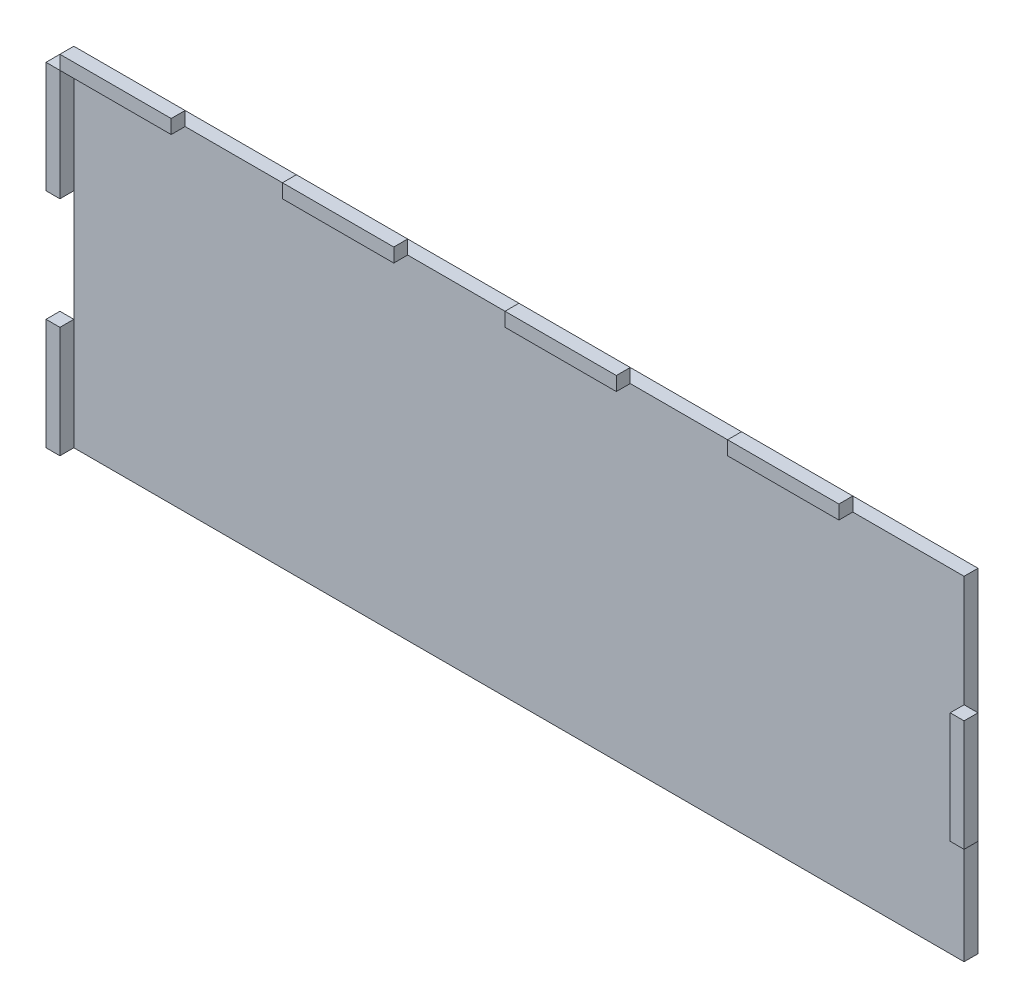
ISO-10303-21;
HEADER;
FILE_DESCRIPTION(('STEP AP214'),'2;1');
FILE_NAME('part.step','',(''),(''),'','','');
FILE_SCHEMA(('AUTOMOTIVE_DESIGN { 1 0 10303 214 1 1 1 1 }'));
ENDSEC;
DATA;
#1=APPLICATION_CONTEXT('core data for automotive mechanical design processes');
#2=APPLICATION_PROTOCOL_DEFINITION('international standard','automotive_design',2000,#1);
#3=PRODUCT_CONTEXT('',#1,'mechanical');
#4=PRODUCT('Part','Part','',(#3));
#5=PRODUCT_RELATED_PRODUCT_CATEGORY('part','',(#4));
#6=PRODUCT_DEFINITION_FORMATION('','',#4);
#7=PRODUCT_DEFINITION_CONTEXT('part definition',#1,'design');
#8=PRODUCT_DEFINITION('design','',#6,#7);
#9=PRODUCT_DEFINITION_SHAPE('','',#8);
#10=(LENGTH_UNIT() NAMED_UNIT(*) SI_UNIT(.MILLI.,.METRE.));
#11=(NAMED_UNIT(*) PLANE_ANGLE_UNIT() SI_UNIT($,.RADIAN.));
#12=(NAMED_UNIT(*) SI_UNIT($,.STERADIAN.) SOLID_ANGLE_UNIT());
#13=UNCERTAINTY_MEASURE_WITH_UNIT(LENGTH_MEASURE(1.E-05),#10,'distance_accuracy_value','');
#14=(GEOMETRIC_REPRESENTATION_CONTEXT(3) GLOBAL_UNCERTAINTY_ASSIGNED_CONTEXT((#13)) GLOBAL_UNIT_ASSIGNED_CONTEXT((#10,
#11,#12)) REPRESENTATION_CONTEXT('',''));
#15=CARTESIAN_POINT('',(0.,0.,0.));
#16=DIRECTION('',(0.,0.,1.));
#17=DIRECTION('',(1.,0.,0.));
#18=AXIS2_PLACEMENT_3D('',#15,#16,#17);
#19=CARTESIAN_POINT('',(101.6,12.7,6.35));
#20=DIRECTION('',(1.,0.,0.));
#21=DIRECTION('',(0.,0.,-1.));
#22=AXIS2_PLACEMENT_3D('',#19,#20,#21);
#23=PLANE('',#22);
#24=DIRECTION('',(0.,-1.,0.));
#25=VECTOR('',#24,1.);
#26=CARTESIAN_POINT('',(101.6,12.7,3.175));
#27=LINE('',#26,#25);
#28=CARTESIAN_POINT('',(101.6,12.7,3.175));
#29=VERTEX_POINT('',#28);
#30=CARTESIAN_POINT('',(101.6,-12.7,3.175));
#31=VERTEX_POINT('',#30);
#32=EDGE_CURVE('E113',#29,#31,#27,.T.);
#33=ORIENTED_EDGE('',*,*,#32,.T.);
#34=DIRECTION('',(0.,0.,-1.));
#35=VECTOR('',#34,1.);
#36=CARTESIAN_POINT('',(101.6,-12.7,6.35));
#37=LINE('',#36,#35);
#38=CARTESIAN_POINT('',(101.6,-12.7,6.35));
#39=VERTEX_POINT('',#38);
#40=EDGE_CURVE('E12',#39,#31,#37,.T.);
#41=ORIENTED_EDGE('',*,*,#40,.F.);
#42=DIRECTION('',(0.,-1.,0.));
#43=VECTOR('',#42,1.);
#44=CARTESIAN_POINT('',(101.6,12.7,6.35));
#45=LINE('',#44,#43);
#46=CARTESIAN_POINT('',(101.6,12.7,6.35));
#47=VERTEX_POINT('',#46);
#48=EDGE_CURVE('E101',#47,#39,#45,.T.);
#49=ORIENTED_EDGE('',*,*,#48,.F.);
#50=DIRECTION('',(0.,0.,-1.));
#51=VECTOR('',#50,1.);
#52=CARTESIAN_POINT('',(101.6,12.7,6.35));
#53=LINE('',#52,#51);
#54=EDGE_CURVE('E109',#47,#29,#53,.T.);
#55=ORIENTED_EDGE('',*,*,#54,.T.);
#56=EDGE_LOOP('',(#33,#41,#49,#55));
#57=FACE_BOUND('',#56,.T.);
#58=ADVANCED_FACE('F50',(#57),#23,.F.);
#59=CARTESIAN_POINT('',(101.6,-12.7,6.35));
#60=DIRECTION('',(0.,1.,0.));
#61=DIRECTION('',(0.,0.,1.));
#62=AXIS2_PLACEMENT_3D('',#59,#60,#61);
#63=PLANE('',#62);
#64=DIRECTION('',(1.,0.,0.));
#65=VECTOR('',#64,1.);
#66=CARTESIAN_POINT('',(101.6,-12.7,3.175));
#67=LINE('',#66,#65);
#68=CARTESIAN_POINT('',(104.775,-12.7,3.175));
#69=VERTEX_POINT('',#68);
#70=EDGE_CURVE('E105',#31,#69,#67,.T.);
#71=ORIENTED_EDGE('',*,*,#70,.T.);
#72=DIRECTION('',(0.,0.,-1.));
#73=VECTOR('',#72,1.);
#74=CARTESIAN_POINT('',(104.775,-12.7,6.35));
#75=LINE('',#74,#73);
#76=CARTESIAN_POINT('',(104.775,-12.7,6.35));
#77=VERTEX_POINT('',#76);
#78=EDGE_CURVE('E58',#77,#69,#75,.T.);
#79=ORIENTED_EDGE('',*,*,#78,.F.);
#80=DIRECTION('',(1.,0.,0.));
#81=VECTOR('',#80,1.);
#82=CARTESIAN_POINT('',(101.6,-12.7,6.35));
#83=LINE('',#82,#81);
#84=EDGE_CURVE('E96',#39,#77,#83,.T.);
#85=ORIENTED_EDGE('',*,*,#84,.F.);
#86=ORIENTED_EDGE('',*,*,#40,.T.);
#87=EDGE_LOOP('',(#71,#79,#85,#86));
#88=FACE_BOUND('',#87,.T.);
#89=ADVANCED_FACE('F104',(#88),#63,.F.);
#90=CARTESIAN_POINT('',(104.775,12.7,6.35));
#91=DIRECTION('',(-1.,0.,0.));
#92=DIRECTION('',(0.,0.,1.));
#93=AXIS2_PLACEMENT_3D('',#90,#91,#92);
#94=PLANE('',#93);
#95=DIRECTION('',(0.,1.,0.));
#96=VECTOR('',#95,1.);
#97=CARTESIAN_POINT('',(104.775,12.7,3.175));
#98=LINE('',#97,#96);
#99=CARTESIAN_POINT('',(104.775,12.7,3.175));
#100=VERTEX_POINT('',#99);
#101=EDGE_CURVE('E83',#69,#100,#98,.T.);
#102=ORIENTED_EDGE('',*,*,#101,.T.);
#103=DIRECTION('',(0.,0.,-1.));
#104=VECTOR('',#103,1.);
#105=CARTESIAN_POINT('',(104.775,12.7,6.35));
#106=LINE('',#105,#104);
#107=CARTESIAN_POINT('',(104.775,12.7,6.35));
#108=VERTEX_POINT('',#107);
#109=EDGE_CURVE('E106',#108,#100,#106,.T.);
#110=ORIENTED_EDGE('',*,*,#109,.F.);
#111=DIRECTION('',(0.,1.,0.));
#112=VECTOR('',#111,1.);
#113=CARTESIAN_POINT('',(104.775,12.7,6.35));
#114=LINE('',#113,#112);
#115=EDGE_CURVE('E99',#77,#108,#114,.T.);
#116=ORIENTED_EDGE('',*,*,#115,.F.);
#117=ORIENTED_EDGE('',*,*,#78,.T.);
#118=EDGE_LOOP('',(#102,#110,#116,#117));
#119=FACE_BOUND('',#118,.T.);
#120=ADVANCED_FACE('F107',(#119),#94,.F.);
#121=CARTESIAN_POINT('',(101.6,12.7,6.35));
#122=DIRECTION('',(0.,-1.,0.));
#123=DIRECTION('',(0.,0.,-1.));
#124=AXIS2_PLACEMENT_3D('',#121,#122,#123);
#125=PLANE('',#124);
#126=DIRECTION('',(-1.,0.,0.));
#127=VECTOR('',#126,1.);
#128=CARTESIAN_POINT('',(101.6,12.7,3.175));
#129=LINE('',#128,#127);
#130=EDGE_CURVE('E89',#100,#29,#129,.T.);
#131=ORIENTED_EDGE('',*,*,#130,.T.);
#132=ORIENTED_EDGE('',*,*,#54,.F.);
#133=DIRECTION('',(-1.,0.,0.));
#134=VECTOR('',#133,1.);
#135=CARTESIAN_POINT('',(101.6,12.7,6.35));
#136=LINE('',#135,#134);
#137=EDGE_CURVE('E66',#108,#47,#136,.T.);
#138=ORIENTED_EDGE('',*,*,#137,.F.);
#139=ORIENTED_EDGE('',*,*,#109,.T.);
#140=EDGE_LOOP('',(#131,#132,#138,#139));
#141=FACE_BOUND('',#140,.T.);
#142=ADVANCED_FACE('F120',(#141),#125,.F.);
#143=CARTESIAN_POINT('',(0.,0.,6.35));
#144=DIRECTION('',(0.,0.,1.));
#145=DIRECTION('',(1.,0.,0.));
#146=AXIS2_PLACEMENT_3D('',#143,#144,#145);
#147=PLANE('',#146);
#148=ORIENTED_EDGE('',*,*,#48,.T.);
#149=ORIENTED_EDGE('',*,*,#84,.T.);
#150=ORIENTED_EDGE('',*,*,#115,.T.);
#151=ORIENTED_EDGE('',*,*,#137,.T.);
#152=EDGE_LOOP('',(#148,#149,#150,#151));
#153=FACE_BOUND('',#152,.T.);
#154=ADVANCED_FACE('F97',(#153),#147,.T.);
#155=CARTESIAN_POINT('',(0.,0.,3.175));
#156=DIRECTION('',(0.,0.,1.));
#157=DIRECTION('',(1.,0.,0.));
#158=AXIS2_PLACEMENT_3D('',#155,#156,#157);
#159=PLANE('',#158);
#160=ORIENTED_EDGE('',*,*,#32,.F.);
#161=ORIENTED_EDGE('',*,*,#130,.F.);
#162=ORIENTED_EDGE('',*,*,#101,.F.);
#163=ORIENTED_EDGE('',*,*,#70,.F.);
#164=EDGE_LOOP('',(#160,#161,#162,#163));
#165=FACE_BOUND('',#164,.T.);
#166=ADVANCED_FACE('F123',(#165),#159,.F.);
#167=CLOSED_SHELL('',(#58,#89,#120,#142,#154,#166));
#168=MANIFOLD_SOLID_BREP('B2',#167);
#169=CARTESIAN_POINT('',(-101.6,38.1,6.35));
#170=DIRECTION('',(-1.,0.,0.));
#171=DIRECTION('',(0.,0.,1.));
#172=AXIS2_PLACEMENT_3D('',#169,#170,#171);
#173=PLANE('',#172);
#174=DIRECTION('',(0.,1.,0.));
#175=VECTOR('',#174,1.);
#176=CARTESIAN_POINT('',(-101.6,38.1,3.175));
#177=LINE('',#176,#175);
#178=CARTESIAN_POINT('',(-101.6,12.7,3.175));
#179=VERTEX_POINT('',#178);
#180=CARTESIAN_POINT('',(-101.6,38.1,3.175));
#181=VERTEX_POINT('',#180);
#182=EDGE_CURVE('E247',#179,#181,#177,.T.);
#183=ORIENTED_EDGE('',*,*,#182,.T.);
#184=DIRECTION('',(0.,0.,-1.));
#185=VECTOR('',#184,1.);
#186=CARTESIAN_POINT('',(-101.6,38.1,6.35));
#187=LINE('',#186,#185);
#188=CARTESIAN_POINT('',(-101.6,38.1,6.35));
#189=VERTEX_POINT('',#188);
#190=EDGE_CURVE('E48',#189,#181,#187,.T.);
#191=ORIENTED_EDGE('',*,*,#190,.F.);
#192=DIRECTION('',(0.,1.,0.));
#193=VECTOR('',#192,1.);
#194=CARTESIAN_POINT('',(-101.6,38.1,6.35));
#195=LINE('',#194,#193);
#196=CARTESIAN_POINT('',(-101.6,12.7,6.35));
#197=VERTEX_POINT('',#196);
#198=EDGE_CURVE('E235',#197,#189,#195,.T.);
#199=ORIENTED_EDGE('',*,*,#198,.F.);
#200=DIRECTION('',(0.,0.,-1.));
#201=VECTOR('',#200,1.);
#202=CARTESIAN_POINT('',(-101.6,12.7,6.35));
#203=LINE('',#202,#201);
#204=EDGE_CURVE('E243',#197,#179,#203,.T.);
#205=ORIENTED_EDGE('',*,*,#204,.T.);
#206=EDGE_LOOP('',(#183,#191,#199,#205));
#207=FACE_BOUND('',#206,.T.);
#208=ADVANCED_FACE('F184',(#207),#173,.F.);
#209=CARTESIAN_POINT('',(-101.6,38.1,6.35));
#210=DIRECTION('',(0.,-1.,0.));
#211=DIRECTION('',(0.,0.,-1.));
#212=AXIS2_PLACEMENT_3D('',#209,#210,#211);
#213=PLANE('',#212);
#214=DIRECTION('',(-1.,0.,0.));
#215=VECTOR('',#214,1.);
#216=CARTESIAN_POINT('',(-101.6,38.1,3.175));
#217=LINE('',#216,#215);
#218=CARTESIAN_POINT('',(-104.775,38.1,3.175));
#219=VERTEX_POINT('',#218);
#220=EDGE_CURVE('E239',#181,#219,#217,.T.);
#221=ORIENTED_EDGE('',*,*,#220,.T.);
#222=DIRECTION('',(0.,0.,-1.));
#223=VECTOR('',#222,1.);
#224=CARTESIAN_POINT('',(-104.775,38.1,6.35));
#225=LINE('',#224,#223);
#226=CARTESIAN_POINT('',(-104.775,38.1,6.35));
#227=VERTEX_POINT('',#226);
#228=EDGE_CURVE('E192',#227,#219,#225,.T.);
#229=ORIENTED_EDGE('',*,*,#228,.F.);
#230=DIRECTION('',(-1.,0.,0.));
#231=VECTOR('',#230,1.);
#232=CARTESIAN_POINT('',(-101.6,38.1,6.35));
#233=LINE('',#232,#231);
#234=EDGE_CURVE('E230',#189,#227,#233,.T.);
#235=ORIENTED_EDGE('',*,*,#234,.F.);
#236=ORIENTED_EDGE('',*,*,#190,.T.);
#237=EDGE_LOOP('',(#221,#229,#235,#236));
#238=FACE_BOUND('',#237,.T.);
#239=ADVANCED_FACE('F238',(#238),#213,.F.);
#240=CARTESIAN_POINT('',(-104.775,38.1,6.35));
#241=DIRECTION('',(1.,0.,0.));
#242=DIRECTION('',(0.,0.,-1.));
#243=AXIS2_PLACEMENT_3D('',#240,#241,#242);
#244=PLANE('',#243);
#245=DIRECTION('',(0.,-1.,0.));
#246=VECTOR('',#245,1.);
#247=CARTESIAN_POINT('',(-104.775,38.1,3.175));
#248=LINE('',#247,#246);
#249=CARTESIAN_POINT('',(-104.775,12.7,3.175));
#250=VERTEX_POINT('',#249);
#251=EDGE_CURVE('E217',#219,#250,#248,.T.);
#252=ORIENTED_EDGE('',*,*,#251,.T.);
#253=DIRECTION('',(0.,0.,-1.));
#254=VECTOR('',#253,1.);
#255=CARTESIAN_POINT('',(-104.775,12.7,6.35));
#256=LINE('',#255,#254);
#257=CARTESIAN_POINT('',(-104.775,12.7,6.35));
#258=VERTEX_POINT('',#257);
#259=EDGE_CURVE('E240',#258,#250,#256,.T.);
#260=ORIENTED_EDGE('',*,*,#259,.F.);
#261=DIRECTION('',(0.,-1.,0.));
#262=VECTOR('',#261,1.);
#263=CARTESIAN_POINT('',(-104.775,38.1,6.35));
#264=LINE('',#263,#262);
#265=EDGE_CURVE('E233',#227,#258,#264,.T.);
#266=ORIENTED_EDGE('',*,*,#265,.F.);
#267=ORIENTED_EDGE('',*,*,#228,.T.);
#268=EDGE_LOOP('',(#252,#260,#266,#267));
#269=FACE_BOUND('',#268,.T.);
#270=ADVANCED_FACE('F241',(#269),#244,.F.);
#271=CARTESIAN_POINT('',(-101.6,12.7,6.35));
#272=DIRECTION('',(0.,1.,0.));
#273=DIRECTION('',(0.,0.,1.));
#274=AXIS2_PLACEMENT_3D('',#271,#272,#273);
#275=PLANE('',#274);
#276=DIRECTION('',(1.,0.,0.));
#277=VECTOR('',#276,1.);
#278=CARTESIAN_POINT('',(-101.6,12.7,3.175));
#279=LINE('',#278,#277);
#280=EDGE_CURVE('E223',#250,#179,#279,.T.);
#281=ORIENTED_EDGE('',*,*,#280,.T.);
#282=ORIENTED_EDGE('',*,*,#204,.F.);
#283=DIRECTION('',(1.,0.,0.));
#284=VECTOR('',#283,1.);
#285=CARTESIAN_POINT('',(-101.6,12.7,6.35));
#286=LINE('',#285,#284);
#287=EDGE_CURVE('E200',#258,#197,#286,.T.);
#288=ORIENTED_EDGE('',*,*,#287,.F.);
#289=ORIENTED_EDGE('',*,*,#259,.T.);
#290=EDGE_LOOP('',(#281,#282,#288,#289));
#291=FACE_BOUND('',#290,.T.);
#292=ADVANCED_FACE('F254',(#291),#275,.F.);
#293=CARTESIAN_POINT('',(0.,0.,6.35));
#294=DIRECTION('',(0.,0.,-1.));
#295=DIRECTION('',(-1.,0.,0.));
#296=AXIS2_PLACEMENT_3D('',#293,#294,#295);
#297=PLANE('',#296);
#298=ORIENTED_EDGE('',*,*,#198,.T.);
#299=ORIENTED_EDGE('',*,*,#234,.T.);
#300=ORIENTED_EDGE('',*,*,#265,.T.);
#301=ORIENTED_EDGE('',*,*,#287,.T.);
#302=EDGE_LOOP('',(#298,#299,#300,#301));
#303=FACE_BOUND('',#302,.T.);
#304=ADVANCED_FACE('F231',(#303),#297,.F.);
#305=CARTESIAN_POINT('',(0.,0.,3.175));
#306=DIRECTION('',(0.,0.,-1.));
#307=DIRECTION('',(-1.,0.,0.));
#308=AXIS2_PLACEMENT_3D('',#305,#306,#307);
#309=PLANE('',#308);
#310=ORIENTED_EDGE('',*,*,#182,.F.);
#311=ORIENTED_EDGE('',*,*,#280,.F.);
#312=ORIENTED_EDGE('',*,*,#251,.F.);
#313=ORIENTED_EDGE('',*,*,#220,.F.);
#314=EDGE_LOOP('',(#310,#311,#312,#313));
#315=FACE_BOUND('',#314,.T.);
#316=ADVANCED_FACE('F257',(#315),#309,.T.);
#317=CLOSED_SHELL('',(#208,#239,#270,#292,#304,#316));
#318=MANIFOLD_SOLID_BREP('B6',#317);
#319=CARTESIAN_POINT('',(-101.6,-38.1,6.35));
#320=DIRECTION('',(-1.,0.,0.));
#321=DIRECTION('',(0.,0.,1.));
#322=AXIS2_PLACEMENT_3D('',#319,#320,#321);
#323=PLANE('',#322);
#324=DIRECTION('',(0.,1.,0.));
#325=VECTOR('',#324,1.);
#326=CARTESIAN_POINT('',(-101.6,-38.1,3.175));
#327=LINE('',#326,#325);
#328=CARTESIAN_POINT('',(-101.6,-38.1,3.175));
#329=VERTEX_POINT('',#328);
#330=CARTESIAN_POINT('',(-101.6,-12.7,3.175));
#331=VERTEX_POINT('',#330);
#332=EDGE_CURVE('E381',#329,#331,#327,.T.);
#333=ORIENTED_EDGE('',*,*,#332,.T.);
#334=DIRECTION('',(0.,0.,-1.));
#335=VECTOR('',#334,1.);
#336=CARTESIAN_POINT('',(-101.6,-12.7,6.35));
#337=LINE('',#336,#335);
#338=CARTESIAN_POINT('',(-101.6,-12.7,6.35));
#339=VERTEX_POINT('',#338);
#340=EDGE_CURVE('E182',#339,#331,#337,.T.);
#341=ORIENTED_EDGE('',*,*,#340,.F.);
#342=DIRECTION('',(0.,1.,0.));
#343=VECTOR('',#342,1.);
#344=CARTESIAN_POINT('',(-101.6,-38.1,6.35));
#345=LINE('',#344,#343);
#346=CARTESIAN_POINT('',(-101.6,-38.1,6.35));
#347=VERTEX_POINT('',#346);
#348=EDGE_CURVE('E369',#347,#339,#345,.T.);
#349=ORIENTED_EDGE('',*,*,#348,.F.);
#350=DIRECTION('',(0.,0.,-1.));
#351=VECTOR('',#350,1.);
#352=CARTESIAN_POINT('',(-101.6,-38.1,6.35));
#353=LINE('',#352,#351);
#354=EDGE_CURVE('E377',#347,#329,#353,.T.);
#355=ORIENTED_EDGE('',*,*,#354,.T.);
#356=EDGE_LOOP('',(#333,#341,#349,#355));
#357=FACE_BOUND('',#356,.T.);
#358=ADVANCED_FACE('F318',(#357),#323,.F.);
#359=CARTESIAN_POINT('',(-101.6,-12.7,6.35));
#360=DIRECTION('',(0.,-1.,0.));
#361=DIRECTION('',(0.,0.,-1.));
#362=AXIS2_PLACEMENT_3D('',#359,#360,#361);
#363=PLANE('',#362);
#364=DIRECTION('',(-1.,0.,0.));
#365=VECTOR('',#364,1.);
#366=CARTESIAN_POINT('',(-101.6,-12.7,3.175));
#367=LINE('',#366,#365);
#368=CARTESIAN_POINT('',(-104.775,-12.7,3.175));
#369=VERTEX_POINT('',#368);
#370=EDGE_CURVE('E373',#331,#369,#367,.T.);
#371=ORIENTED_EDGE('',*,*,#370,.T.);
#372=DIRECTION('',(0.,0.,-1.));
#373=VECTOR('',#372,1.);
#374=CARTESIAN_POINT('',(-104.775,-12.7,6.35));
#375=LINE('',#374,#373);
#376=CARTESIAN_POINT('',(-104.775,-12.7,6.35));
#377=VERTEX_POINT('',#376);
#378=EDGE_CURVE('E326',#377,#369,#375,.T.);
#379=ORIENTED_EDGE('',*,*,#378,.F.);
#380=DIRECTION('',(-1.,0.,0.));
#381=VECTOR('',#380,1.);
#382=CARTESIAN_POINT('',(-101.6,-12.7,6.35));
#383=LINE('',#382,#381);
#384=EDGE_CURVE('E364',#339,#377,#383,.T.);
#385=ORIENTED_EDGE('',*,*,#384,.F.);
#386=ORIENTED_EDGE('',*,*,#340,.T.);
#387=EDGE_LOOP('',(#371,#379,#385,#386));
#388=FACE_BOUND('',#387,.T.);
#389=ADVANCED_FACE('F372',(#388),#363,.F.);
#390=CARTESIAN_POINT('',(-104.775,-38.1,6.35));
#391=DIRECTION('',(1.,0.,0.));
#392=DIRECTION('',(0.,0.,-1.));
#393=AXIS2_PLACEMENT_3D('',#390,#391,#392);
#394=PLANE('',#393);
#395=DIRECTION('',(0.,-1.,0.));
#396=VECTOR('',#395,1.);
#397=CARTESIAN_POINT('',(-104.775,-38.1,3.175));
#398=LINE('',#397,#396);
#399=CARTESIAN_POINT('',(-104.775,-38.1,3.175));
#400=VERTEX_POINT('',#399);
#401=EDGE_CURVE('E351',#369,#400,#398,.T.);
#402=ORIENTED_EDGE('',*,*,#401,.T.);
#403=DIRECTION('',(0.,0.,-1.));
#404=VECTOR('',#403,1.);
#405=CARTESIAN_POINT('',(-104.775,-38.1,6.35));
#406=LINE('',#405,#404);
#407=CARTESIAN_POINT('',(-104.775,-38.1,6.35));
#408=VERTEX_POINT('',#407);
#409=EDGE_CURVE('E374',#408,#400,#406,.T.);
#410=ORIENTED_EDGE('',*,*,#409,.F.);
#411=DIRECTION('',(0.,-1.,0.));
#412=VECTOR('',#411,1.);
#413=CARTESIAN_POINT('',(-104.775,-38.1,6.35));
#414=LINE('',#413,#412);
#415=EDGE_CURVE('E367',#377,#408,#414,.T.);
#416=ORIENTED_EDGE('',*,*,#415,.F.);
#417=ORIENTED_EDGE('',*,*,#378,.T.);
#418=EDGE_LOOP('',(#402,#410,#416,#417));
#419=FACE_BOUND('',#418,.T.);
#420=ADVANCED_FACE('F375',(#419),#394,.F.);
#421=CARTESIAN_POINT('',(-101.6,-38.1,6.35));
#422=DIRECTION('',(0.,1.,0.));
#423=DIRECTION('',(0.,0.,1.));
#424=AXIS2_PLACEMENT_3D('',#421,#422,#423);
#425=PLANE('',#424);
#426=DIRECTION('',(1.,0.,0.));
#427=VECTOR('',#426,1.);
#428=CARTESIAN_POINT('',(-101.6,-38.1,3.175));
#429=LINE('',#428,#427);
#430=EDGE_CURVE('E357',#400,#329,#429,.T.);
#431=ORIENTED_EDGE('',*,*,#430,.T.);
#432=ORIENTED_EDGE('',*,*,#354,.F.);
#433=DIRECTION('',(1.,0.,0.));
#434=VECTOR('',#433,1.);
#435=CARTESIAN_POINT('',(-101.6,-38.1,6.35));
#436=LINE('',#435,#434);
#437=EDGE_CURVE('E334',#408,#347,#436,.T.);
#438=ORIENTED_EDGE('',*,*,#437,.F.);
#439=ORIENTED_EDGE('',*,*,#409,.T.);
#440=EDGE_LOOP('',(#431,#432,#438,#439));
#441=FACE_BOUND('',#440,.T.);
#442=ADVANCED_FACE('F388',(#441),#425,.F.);
#443=CARTESIAN_POINT('',(0.,0.,6.35));
#444=DIRECTION('',(0.,0.,1.));
#445=DIRECTION('',(1.,0.,0.));
#446=AXIS2_PLACEMENT_3D('',#443,#444,#445);
#447=PLANE('',#446);
#448=ORIENTED_EDGE('',*,*,#348,.T.);
#449=ORIENTED_EDGE('',*,*,#384,.T.);
#450=ORIENTED_EDGE('',*,*,#415,.T.);
#451=ORIENTED_EDGE('',*,*,#437,.T.);
#452=EDGE_LOOP('',(#448,#449,#450,#451));
#453=FACE_BOUND('',#452,.T.);
#454=ADVANCED_FACE('F365',(#453),#447,.T.);
#455=CARTESIAN_POINT('',(0.,0.,3.175));
#456=DIRECTION('',(0.,0.,1.));
#457=DIRECTION('',(1.,0.,0.));
#458=AXIS2_PLACEMENT_3D('',#455,#456,#457);
#459=PLANE('',#458);
#460=ORIENTED_EDGE('',*,*,#332,.F.);
#461=ORIENTED_EDGE('',*,*,#430,.F.);
#462=ORIENTED_EDGE('',*,*,#401,.F.);
#463=ORIENTED_EDGE('',*,*,#370,.F.);
#464=EDGE_LOOP('',(#460,#461,#462,#463));
#465=FACE_BOUND('',#464,.T.);
#466=ADVANCED_FACE('F391',(#465),#459,.F.);
#467=CLOSED_SHELL('',(#358,#389,#420,#442,#454,#466));
#468=MANIFOLD_SOLID_BREP('B42',#467);
#469=CARTESIAN_POINT('',(50.8,38.1,6.35));
#470=DIRECTION('',(0.,1.,0.));
#471=DIRECTION('',(0.,0.,1.));
#472=AXIS2_PLACEMENT_3D('',#469,#470,#471);
#473=PLANE('',#472);
#474=DIRECTION('',(1.,0.,0.));
#475=VECTOR('',#474,1.);
#476=CARTESIAN_POINT('',(50.8,38.1,3.175));
#477=LINE('',#476,#475);
#478=CARTESIAN_POINT('',(50.8,38.1,3.175));
#479=VERTEX_POINT('',#478);
#480=CARTESIAN_POINT('',(76.2,38.1,3.175));
#481=VERTEX_POINT('',#480);
#482=EDGE_CURVE('E514',#479,#481,#477,.T.);
#483=ORIENTED_EDGE('',*,*,#482,.T.);
#484=DIRECTION('',(0.,0.,-1.));
#485=VECTOR('',#484,1.);
#486=CARTESIAN_POINT('',(76.2,38.1,6.35));
#487=LINE('',#486,#485);
#488=CARTESIAN_POINT('',(76.2,38.1,6.35));
#489=VERTEX_POINT('',#488);
#490=EDGE_CURVE('E316',#489,#481,#487,.T.);
#491=ORIENTED_EDGE('',*,*,#490,.F.);
#492=DIRECTION('',(1.,0.,0.));
#493=VECTOR('',#492,1.);
#494=CARTESIAN_POINT('',(50.8,38.1,6.35));
#495=LINE('',#494,#493);
#496=CARTESIAN_POINT('',(50.8,38.1,6.35));
#497=VERTEX_POINT('',#496);
#498=EDGE_CURVE('E502',#497,#489,#495,.T.);
#499=ORIENTED_EDGE('',*,*,#498,.F.);
#500=DIRECTION('',(0.,0.,-1.));
#501=VECTOR('',#500,1.);
#502=CARTESIAN_POINT('',(50.8,38.1,6.35));
#503=LINE('',#502,#501);
#504=EDGE_CURVE('E510',#497,#479,#503,.T.);
#505=ORIENTED_EDGE('',*,*,#504,.T.);
#506=EDGE_LOOP('',(#483,#491,#499,#505));
#507=FACE_BOUND('',#506,.T.);
#508=ADVANCED_FACE('F451',(#507),#473,.F.);
#509=CARTESIAN_POINT('',(76.2,38.1,6.35));
#510=DIRECTION('',(-1.,0.,0.));
#511=DIRECTION('',(0.,0.,1.));
#512=AXIS2_PLACEMENT_3D('',#509,#510,#511);
#513=PLANE('',#512);
#514=DIRECTION('',(0.,1.,0.));
#515=VECTOR('',#514,1.);
#516=CARTESIAN_POINT('',(76.2,38.1,3.175));
#517=LINE('',#516,#515);
#518=CARTESIAN_POINT('',(76.2,41.275,3.175));
#519=VERTEX_POINT('',#518);
#520=EDGE_CURVE('E506',#481,#519,#517,.T.);
#521=ORIENTED_EDGE('',*,*,#520,.T.);
#522=DIRECTION('',(0.,0.,-1.));
#523=VECTOR('',#522,1.);
#524=CARTESIAN_POINT('',(76.2,41.275,6.35));
#525=LINE('',#524,#523);
#526=CARTESIAN_POINT('',(76.2,41.275,6.35));
#527=VERTEX_POINT('',#526);
#528=EDGE_CURVE('E459',#527,#519,#525,.T.);
#529=ORIENTED_EDGE('',*,*,#528,.F.);
#530=DIRECTION('',(0.,1.,0.));
#531=VECTOR('',#530,1.);
#532=CARTESIAN_POINT('',(76.2,38.1,6.35));
#533=LINE('',#532,#531);
#534=EDGE_CURVE('E497',#489,#527,#533,.T.);
#535=ORIENTED_EDGE('',*,*,#534,.F.);
#536=ORIENTED_EDGE('',*,*,#490,.T.);
#537=EDGE_LOOP('',(#521,#529,#535,#536));
#538=FACE_BOUND('',#537,.T.);
#539=ADVANCED_FACE('F505',(#538),#513,.F.);
#540=CARTESIAN_POINT('',(50.8,41.275,6.35));
#541=DIRECTION('',(0.,-1.,0.));
#542=DIRECTION('',(1.,0.,0.));
#543=AXIS2_PLACEMENT_3D('',#540,#541,#542);
#544=PLANE('',#543);
#545=DIRECTION('',(-1.,0.,0.));
#546=VECTOR('',#545,1.);
#547=CARTESIAN_POINT('',(50.8,41.275,3.175));
#548=LINE('',#547,#546);
#549=CARTESIAN_POINT('',(50.8,41.275,3.175));
#550=VERTEX_POINT('',#549);
#551=EDGE_CURVE('E484',#519,#550,#548,.T.);
#552=ORIENTED_EDGE('',*,*,#551,.T.);
#553=DIRECTION('',(0.,0.,-1.));
#554=VECTOR('',#553,1.);
#555=CARTESIAN_POINT('',(50.8,41.275,6.35));
#556=LINE('',#555,#554);
#557=CARTESIAN_POINT('',(50.8,41.275,6.35));
#558=VERTEX_POINT('',#557);
#559=EDGE_CURVE('E507',#558,#550,#556,.T.);
#560=ORIENTED_EDGE('',*,*,#559,.F.);
#561=DIRECTION('',(-1.,0.,0.));
#562=VECTOR('',#561,1.);
#563=CARTESIAN_POINT('',(50.8,41.275,6.35));
#564=LINE('',#563,#562);
#565=EDGE_CURVE('E500',#527,#558,#564,.T.);
#566=ORIENTED_EDGE('',*,*,#565,.F.);
#567=ORIENTED_EDGE('',*,*,#528,.T.);
#568=EDGE_LOOP('',(#552,#560,#566,#567));
#569=FACE_BOUND('',#568,.T.);
#570=ADVANCED_FACE('F508',(#569),#544,.F.);
#571=CARTESIAN_POINT('',(50.8,38.1,6.35));
#572=DIRECTION('',(1.,0.,0.));
#573=DIRECTION('',(0.,0.,-1.));
#574=AXIS2_PLACEMENT_3D('',#571,#572,#573);
#575=PLANE('',#574);
#576=DIRECTION('',(0.,-1.,0.));
#577=VECTOR('',#576,1.);
#578=CARTESIAN_POINT('',(50.8,38.1,3.175));
#579=LINE('',#578,#577);
#580=EDGE_CURVE('E490',#550,#479,#579,.T.);
#581=ORIENTED_EDGE('',*,*,#580,.T.);
#582=ORIENTED_EDGE('',*,*,#504,.F.);
#583=DIRECTION('',(0.,-1.,0.));
#584=VECTOR('',#583,1.);
#585=CARTESIAN_POINT('',(50.8,38.1,6.35));
#586=LINE('',#585,#584);
#587=EDGE_CURVE('E467',#558,#497,#586,.T.);
#588=ORIENTED_EDGE('',*,*,#587,.F.);
#589=ORIENTED_EDGE('',*,*,#559,.T.);
#590=EDGE_LOOP('',(#581,#582,#588,#589));
#591=FACE_BOUND('',#590,.T.);
#592=ADVANCED_FACE('F521',(#591),#575,.F.);
#593=CARTESIAN_POINT('',(0.,0.,6.35));
#594=DIRECTION('',(0.,0.,1.));
#595=DIRECTION('',(1.,0.,0.));
#596=AXIS2_PLACEMENT_3D('',#593,#594,#595);
#597=PLANE('',#596);
#598=ORIENTED_EDGE('',*,*,#498,.T.);
#599=ORIENTED_EDGE('',*,*,#534,.T.);
#600=ORIENTED_EDGE('',*,*,#565,.T.);
#601=ORIENTED_EDGE('',*,*,#587,.T.);
#602=EDGE_LOOP('',(#598,#599,#600,#601));
#603=FACE_BOUND('',#602,.T.);
#604=ADVANCED_FACE('F498',(#603),#597,.T.);
#605=CARTESIAN_POINT('',(0.,0.,3.175));
#606=DIRECTION('',(0.,0.,1.));
#607=DIRECTION('',(1.,0.,0.));
#608=AXIS2_PLACEMENT_3D('',#605,#606,#607);
#609=PLANE('',#608);
#610=ORIENTED_EDGE('',*,*,#482,.F.);
#611=ORIENTED_EDGE('',*,*,#580,.F.);
#612=ORIENTED_EDGE('',*,*,#551,.F.);
#613=ORIENTED_EDGE('',*,*,#520,.F.);
#614=EDGE_LOOP('',(#610,#611,#612,#613));
#615=FACE_BOUND('',#614,.T.);
#616=ADVANCED_FACE('F524',(#615),#609,.F.);
#617=CLOSED_SHELL('',(#508,#539,#570,#592,#604,#616));
#618=MANIFOLD_SOLID_BREP('B176',#617);
#619=CARTESIAN_POINT('',(0.,38.1,6.35));
#620=DIRECTION('',(0.,1.,0.));
#621=DIRECTION('',(0.,0.,1.));
#622=AXIS2_PLACEMENT_3D('',#619,#620,#621);
#623=PLANE('',#622);
#624=DIRECTION('',(1.,0.,0.));
#625=VECTOR('',#624,1.);
#626=CARTESIAN_POINT('',(0.,38.1,3.175));
#627=LINE('',#626,#625);
#628=CARTESIAN_POINT('',(0.,38.1,3.175));
#629=VERTEX_POINT('',#628);
#630=CARTESIAN_POINT('',(25.4,38.1,3.175));
#631=VERTEX_POINT('',#630);
#632=EDGE_CURVE('E647',#629,#631,#627,.T.);
#633=ORIENTED_EDGE('',*,*,#632,.T.);
#634=DIRECTION('',(0.,0.,-1.));
#635=VECTOR('',#634,1.);
#636=CARTESIAN_POINT('',(25.4,38.1,6.35));
#637=LINE('',#636,#635);
#638=CARTESIAN_POINT('',(25.4,38.1,6.35));
#639=VERTEX_POINT('',#638);
#640=EDGE_CURVE('E449',#639,#631,#637,.T.);
#641=ORIENTED_EDGE('',*,*,#640,.F.);
#642=DIRECTION('',(1.,0.,0.));
#643=VECTOR('',#642,1.);
#644=CARTESIAN_POINT('',(0.,38.1,6.35));
#645=LINE('',#644,#643);
#646=CARTESIAN_POINT('',(0.,38.1,6.35));
#647=VERTEX_POINT('',#646);
#648=EDGE_CURVE('E635',#647,#639,#645,.T.);
#649=ORIENTED_EDGE('',*,*,#648,.F.);
#650=DIRECTION('',(0.,0.,-1.));
#651=VECTOR('',#650,1.);
#652=CARTESIAN_POINT('',(0.,38.1,6.35));
#653=LINE('',#652,#651);
#654=EDGE_CURVE('E643',#647,#629,#653,.T.);
#655=ORIENTED_EDGE('',*,*,#654,.T.);
#656=EDGE_LOOP('',(#633,#641,#649,#655));
#657=FACE_BOUND('',#656,.T.);
#658=ADVANCED_FACE('F584',(#657),#623,.F.);
#659=CARTESIAN_POINT('',(25.4,38.1,6.35));
#660=DIRECTION('',(-1.,0.,0.));
#661=DIRECTION('',(0.,-1.,0.));
#662=AXIS2_PLACEMENT_3D('',#659,#660,#661);
#663=PLANE('',#662);
#664=DIRECTION('',(0.,1.,0.));
#665=VECTOR('',#664,1.);
#666=CARTESIAN_POINT('',(25.4,38.1,3.175));
#667=LINE('',#666,#665);
#668=CARTESIAN_POINT('',(25.4,41.275,3.175));
#669=VERTEX_POINT('',#668);
#670=EDGE_CURVE('E639',#631,#669,#667,.T.);
#671=ORIENTED_EDGE('',*,*,#670,.T.);
#672=DIRECTION('',(0.,0.,-1.));
#673=VECTOR('',#672,1.);
#674=CARTESIAN_POINT('',(25.4,41.275,6.35));
#675=LINE('',#674,#673);
#676=CARTESIAN_POINT('',(25.4,41.275,6.35));
#677=VERTEX_POINT('',#676);
#678=EDGE_CURVE('E592',#677,#669,#675,.T.);
#679=ORIENTED_EDGE('',*,*,#678,.F.);
#680=DIRECTION('',(0.,1.,0.));
#681=VECTOR('',#680,1.);
#682=CARTESIAN_POINT('',(25.4,38.1,6.35));
#683=LINE('',#682,#681);
#684=EDGE_CURVE('E630',#639,#677,#683,.T.);
#685=ORIENTED_EDGE('',*,*,#684,.F.);
#686=ORIENTED_EDGE('',*,*,#640,.T.);
#687=EDGE_LOOP('',(#671,#679,#685,#686));
#688=FACE_BOUND('',#687,.T.);
#689=ADVANCED_FACE('F638',(#688),#663,.F.);
#690=CARTESIAN_POINT('',(0.,41.275,6.35));
#691=DIRECTION('',(0.,-1.,0.));
#692=DIRECTION('',(1.,0.,0.));
#693=AXIS2_PLACEMENT_3D('',#690,#691,#692);
#694=PLANE('',#693);
#695=DIRECTION('',(-1.,0.,0.));
#696=VECTOR('',#695,1.);
#697=CARTESIAN_POINT('',(0.,41.275,3.175));
#698=LINE('',#697,#696);
#699=CARTESIAN_POINT('',(0.,41.275,3.175));
#700=VERTEX_POINT('',#699);
#701=EDGE_CURVE('E617',#669,#700,#698,.T.);
#702=ORIENTED_EDGE('',*,*,#701,.T.);
#703=DIRECTION('',(0.,0.,-1.));
#704=VECTOR('',#703,1.);
#705=CARTESIAN_POINT('',(0.,41.275,6.35));
#706=LINE('',#705,#704);
#707=CARTESIAN_POINT('',(0.,41.275,6.35));
#708=VERTEX_POINT('',#707);
#709=EDGE_CURVE('E640',#708,#700,#706,.T.);
#710=ORIENTED_EDGE('',*,*,#709,.F.);
#711=DIRECTION('',(-1.,0.,0.));
#712=VECTOR('',#711,1.);
#713=CARTESIAN_POINT('',(0.,41.275,6.35));
#714=LINE('',#713,#712);
#715=EDGE_CURVE('E633',#677,#708,#714,.T.);
#716=ORIENTED_EDGE('',*,*,#715,.F.);
#717=ORIENTED_EDGE('',*,*,#678,.T.);
#718=EDGE_LOOP('',(#702,#710,#716,#717));
#719=FACE_BOUND('',#718,.T.);
#720=ADVANCED_FACE('F641',(#719),#694,.F.);
#721=CARTESIAN_POINT('',(0.,38.1,6.35));
#722=DIRECTION('',(1.,0.,0.));
#723=DIRECTION('',(0.,1.,0.));
#724=AXIS2_PLACEMENT_3D('',#721,#722,#723);
#725=PLANE('',#724);
#726=DIRECTION('',(0.,-1.,0.));
#727=VECTOR('',#726,1.);
#728=CARTESIAN_POINT('',(0.,38.1,3.175));
#729=LINE('',#728,#727);
#730=EDGE_CURVE('E623',#700,#629,#729,.T.);
#731=ORIENTED_EDGE('',*,*,#730,.T.);
#732=ORIENTED_EDGE('',*,*,#654,.F.);
#733=DIRECTION('',(0.,-1.,0.));
#734=VECTOR('',#733,1.);
#735=CARTESIAN_POINT('',(0.,38.1,6.35));
#736=LINE('',#735,#734);
#737=EDGE_CURVE('E600',#708,#647,#736,.T.);
#738=ORIENTED_EDGE('',*,*,#737,.F.);
#739=ORIENTED_EDGE('',*,*,#709,.T.);
#740=EDGE_LOOP('',(#731,#732,#738,#739));
#741=FACE_BOUND('',#740,.T.);
#742=ADVANCED_FACE('F654',(#741),#725,.F.);
#743=CARTESIAN_POINT('',(0.,0.,6.35));
#744=DIRECTION('',(0.,0.,1.));
#745=DIRECTION('',(1.,0.,0.));
#746=AXIS2_PLACEMENT_3D('',#743,#744,#745);
#747=PLANE('',#746);
#748=ORIENTED_EDGE('',*,*,#648,.T.);
#749=ORIENTED_EDGE('',*,*,#684,.T.);
#750=ORIENTED_EDGE('',*,*,#715,.T.);
#751=ORIENTED_EDGE('',*,*,#737,.T.);
#752=EDGE_LOOP('',(#748,#749,#750,#751));
#753=FACE_BOUND('',#752,.T.);
#754=ADVANCED_FACE('F631',(#753),#747,.T.);
#755=CARTESIAN_POINT('',(0.,0.,3.175));
#756=DIRECTION('',(0.,0.,1.));
#757=DIRECTION('',(1.,0.,0.));
#758=AXIS2_PLACEMENT_3D('',#755,#756,#757);
#759=PLANE('',#758);
#760=ORIENTED_EDGE('',*,*,#632,.F.);
#761=ORIENTED_EDGE('',*,*,#730,.F.);
#762=ORIENTED_EDGE('',*,*,#701,.F.);
#763=ORIENTED_EDGE('',*,*,#670,.F.);
#764=EDGE_LOOP('',(#760,#761,#762,#763));
#765=FACE_BOUND('',#764,.T.);
#766=ADVANCED_FACE('F657',(#765),#759,.F.);
#767=CLOSED_SHELL('',(#658,#689,#720,#742,#754,#766));
#768=MANIFOLD_SOLID_BREP('B310',#767);
#769=CARTESIAN_POINT('',(-50.8,38.1,6.35));
#770=DIRECTION('',(0.,1.,0.));
#771=DIRECTION('',(0.,0.,1.));
#772=AXIS2_PLACEMENT_3D('',#769,#770,#771);
#773=PLANE('',#772);
#774=DIRECTION('',(1.,0.,0.));
#775=VECTOR('',#774,1.);
#776=CARTESIAN_POINT('',(-50.8,38.1,3.175));
#777=LINE('',#776,#775);
#778=CARTESIAN_POINT('',(-50.8,38.1,3.175));
#779=VERTEX_POINT('',#778);
#780=CARTESIAN_POINT('',(-25.4,38.1,3.175));
#781=VERTEX_POINT('',#780);
#782=EDGE_CURVE('E780',#779,#781,#777,.T.);
#783=ORIENTED_EDGE('',*,*,#782,.T.);
#784=DIRECTION('',(0.,0.,-1.));
#785=VECTOR('',#784,1.);
#786=CARTESIAN_POINT('',(-25.4,38.1,6.35));
#787=LINE('',#786,#785);
#788=CARTESIAN_POINT('',(-25.4,38.1,6.35));
#789=VERTEX_POINT('',#788);
#790=EDGE_CURVE('E582',#789,#781,#787,.T.);
#791=ORIENTED_EDGE('',*,*,#790,.F.);
#792=DIRECTION('',(1.,0.,0.));
#793=VECTOR('',#792,1.);
#794=CARTESIAN_POINT('',(-50.8,38.1,6.35));
#795=LINE('',#794,#793);
#796=CARTESIAN_POINT('',(-50.8,38.1,6.35));
#797=VERTEX_POINT('',#796);
#798=EDGE_CURVE('E768',#797,#789,#795,.T.);
#799=ORIENTED_EDGE('',*,*,#798,.F.);
#800=DIRECTION('',(0.,0.,-1.));
#801=VECTOR('',#800,1.);
#802=CARTESIAN_POINT('',(-50.8,38.1,6.35));
#803=LINE('',#802,#801);
#804=EDGE_CURVE('E776',#797,#779,#803,.T.);
#805=ORIENTED_EDGE('',*,*,#804,.T.);
#806=EDGE_LOOP('',(#783,#791,#799,#805));
#807=FACE_BOUND('',#806,.T.);
#808=ADVANCED_FACE('F717',(#807),#773,.F.);
#809=CARTESIAN_POINT('',(-25.4,38.1,6.35));
#810=DIRECTION('',(-1.,0.,0.));
#811=DIRECTION('',(0.,-1.,0.));
#812=AXIS2_PLACEMENT_3D('',#809,#810,#811);
#813=PLANE('',#812);
#814=DIRECTION('',(0.,1.,0.));
#815=VECTOR('',#814,1.);
#816=CARTESIAN_POINT('',(-25.4,38.1,3.175));
#817=LINE('',#816,#815);
#818=CARTESIAN_POINT('',(-25.4,41.275,3.175));
#819=VERTEX_POINT('',#818);
#820=EDGE_CURVE('E772',#781,#819,#817,.T.);
#821=ORIENTED_EDGE('',*,*,#820,.T.);
#822=DIRECTION('',(0.,0.,-1.));
#823=VECTOR('',#822,1.);
#824=CARTESIAN_POINT('',(-25.4,41.275,6.35));
#825=LINE('',#824,#823);
#826=CARTESIAN_POINT('',(-25.4,41.275,6.35));
#827=VERTEX_POINT('',#826);
#828=EDGE_CURVE('E725',#827,#819,#825,.T.);
#829=ORIENTED_EDGE('',*,*,#828,.F.);
#830=DIRECTION('',(0.,1.,0.));
#831=VECTOR('',#830,1.);
#832=CARTESIAN_POINT('',(-25.4,38.1,6.35));
#833=LINE('',#832,#831);
#834=EDGE_CURVE('E763',#789,#827,#833,.T.);
#835=ORIENTED_EDGE('',*,*,#834,.F.);
#836=ORIENTED_EDGE('',*,*,#790,.T.);
#837=EDGE_LOOP('',(#821,#829,#835,#836));
#838=FACE_BOUND('',#837,.T.);
#839=ADVANCED_FACE('F771',(#838),#813,.F.);
#840=CARTESIAN_POINT('',(-50.8,41.275,6.35));
#841=DIRECTION('',(0.,-1.,0.));
#842=DIRECTION('',(1.,0.,0.));
#843=AXIS2_PLACEMENT_3D('',#840,#841,#842);
#844=PLANE('',#843);
#845=DIRECTION('',(-1.,0.,0.));
#846=VECTOR('',#845,1.);
#847=CARTESIAN_POINT('',(-50.8,41.275,3.175));
#848=LINE('',#847,#846);
#849=CARTESIAN_POINT('',(-50.8,41.275,3.175));
#850=VERTEX_POINT('',#849);
#851=EDGE_CURVE('E750',#819,#850,#848,.T.);
#852=ORIENTED_EDGE('',*,*,#851,.T.);
#853=DIRECTION('',(0.,0.,-1.));
#854=VECTOR('',#853,1.);
#855=CARTESIAN_POINT('',(-50.8,41.275,6.35));
#856=LINE('',#855,#854);
#857=CARTESIAN_POINT('',(-50.8,41.275,6.35));
#858=VERTEX_POINT('',#857);
#859=EDGE_CURVE('E773',#858,#850,#856,.T.);
#860=ORIENTED_EDGE('',*,*,#859,.F.);
#861=DIRECTION('',(-1.,0.,0.));
#862=VECTOR('',#861,1.);
#863=CARTESIAN_POINT('',(-50.8,41.275,6.35));
#864=LINE('',#863,#862);
#865=EDGE_CURVE('E766',#827,#858,#864,.T.);
#866=ORIENTED_EDGE('',*,*,#865,.F.);
#867=ORIENTED_EDGE('',*,*,#828,.T.);
#868=EDGE_LOOP('',(#852,#860,#866,#867));
#869=FACE_BOUND('',#868,.T.);
#870=ADVANCED_FACE('F774',(#869),#844,.F.);
#871=CARTESIAN_POINT('',(-50.8,38.1,6.35));
#872=DIRECTION('',(1.,0.,0.));
#873=DIRECTION('',(0.,1.,0.));
#874=AXIS2_PLACEMENT_3D('',#871,#872,#873);
#875=PLANE('',#874);
#876=DIRECTION('',(0.,-1.,0.));
#877=VECTOR('',#876,1.);
#878=CARTESIAN_POINT('',(-50.8,38.1,3.175));
#879=LINE('',#878,#877);
#880=EDGE_CURVE('E756',#850,#779,#879,.T.);
#881=ORIENTED_EDGE('',*,*,#880,.T.);
#882=ORIENTED_EDGE('',*,*,#804,.F.);
#883=DIRECTION('',(0.,-1.,0.));
#884=VECTOR('',#883,1.);
#885=CARTESIAN_POINT('',(-50.8,38.1,6.35));
#886=LINE('',#885,#884);
#887=EDGE_CURVE('E733',#858,#797,#886,.T.);
#888=ORIENTED_EDGE('',*,*,#887,.F.);
#889=ORIENTED_EDGE('',*,*,#859,.T.);
#890=EDGE_LOOP('',(#881,#882,#888,#889));
#891=FACE_BOUND('',#890,.T.);
#892=ADVANCED_FACE('F787',(#891),#875,.F.);
#893=CARTESIAN_POINT('',(0.,0.,6.35));
#894=DIRECTION('',(0.,0.,1.));
#895=DIRECTION('',(1.,0.,0.));
#896=AXIS2_PLACEMENT_3D('',#893,#894,#895);
#897=PLANE('',#896);
#898=ORIENTED_EDGE('',*,*,#798,.T.);
#899=ORIENTED_EDGE('',*,*,#834,.T.);
#900=ORIENTED_EDGE('',*,*,#865,.T.);
#901=ORIENTED_EDGE('',*,*,#887,.T.);
#902=EDGE_LOOP('',(#898,#899,#900,#901));
#903=FACE_BOUND('',#902,.T.);
#904=ADVANCED_FACE('F764',(#903),#897,.T.);
#905=CARTESIAN_POINT('',(0.,0.,3.175));
#906=DIRECTION('',(0.,0.,1.));
#907=DIRECTION('',(1.,0.,0.));
#908=AXIS2_PLACEMENT_3D('',#905,#906,#907);
#909=PLANE('',#908);
#910=ORIENTED_EDGE('',*,*,#782,.F.);
#911=ORIENTED_EDGE('',*,*,#880,.F.);
#912=ORIENTED_EDGE('',*,*,#851,.F.);
#913=ORIENTED_EDGE('',*,*,#820,.F.);
#914=EDGE_LOOP('',(#910,#911,#912,#913));
#915=FACE_BOUND('',#914,.T.);
#916=ADVANCED_FACE('F790',(#915),#909,.F.);
#917=CLOSED_SHELL('',(#808,#839,#870,#892,#904,#916));
#918=MANIFOLD_SOLID_BREP('B443',#917);
#919=CARTESIAN_POINT('',(-101.6,38.1,6.35));
#920=DIRECTION('',(1.,0.,0.));
#921=DIRECTION('',(0.,0.,-1.));
#922=AXIS2_PLACEMENT_3D('',#919,#920,#921);
#923=PLANE('',#922);
#924=DIRECTION('',(0.,-1.,0.));
#925=VECTOR('',#924,1.);
#926=CARTESIAN_POINT('',(-101.6,38.1,3.175));
#927=LINE('',#926,#925);
#928=CARTESIAN_POINT('',(-101.6,41.275,3.175));
#929=VERTEX_POINT('',#928);
#930=CARTESIAN_POINT('',(-101.6,38.1,3.175));
#931=VERTEX_POINT('',#930);
#932=EDGE_CURVE('E912',#929,#931,#927,.T.);
#933=ORIENTED_EDGE('',*,*,#932,.T.);
#934=DIRECTION('',(0.,0.,-1.));
#935=VECTOR('',#934,1.);
#936=CARTESIAN_POINT('',(-101.6,38.1,6.35));
#937=LINE('',#936,#935);
#938=CARTESIAN_POINT('',(-101.6,38.1,6.35));
#939=VERTEX_POINT('',#938);
#940=EDGE_CURVE('E715',#939,#931,#937,.T.);
#941=ORIENTED_EDGE('',*,*,#940,.F.);
#942=DIRECTION('',(0.,-1.,0.));
#943=VECTOR('',#942,1.);
#944=CARTESIAN_POINT('',(-101.6,38.1,6.35));
#945=LINE('',#944,#943);
#946=CARTESIAN_POINT('',(-101.6,41.275,6.35));
#947=VERTEX_POINT('',#946);
#948=EDGE_CURVE('E900',#947,#939,#945,.T.);
#949=ORIENTED_EDGE('',*,*,#948,.F.);
#950=DIRECTION('',(0.,0.,-1.));
#951=VECTOR('',#950,1.);
#952=CARTESIAN_POINT('',(-101.6,41.275,6.35));
#953=LINE('',#952,#951);
#954=EDGE_CURVE('E908',#947,#929,#953,.T.);
#955=ORIENTED_EDGE('',*,*,#954,.T.);
#956=EDGE_LOOP('',(#933,#941,#949,#955));
#957=FACE_BOUND('',#956,.T.);
#958=ADVANCED_FACE('F849',(#957),#923,.F.);
#959=CARTESIAN_POINT('',(-101.6,38.1,6.35));
#960=DIRECTION('',(0.,1.,0.));
#961=DIRECTION('',(0.,0.,1.));
#962=AXIS2_PLACEMENT_3D('',#959,#960,#961);
#963=PLANE('',#962);
#964=DIRECTION('',(1.,0.,0.));
#965=VECTOR('',#964,1.);
#966=CARTESIAN_POINT('',(-101.6,38.1,3.175));
#967=LINE('',#966,#965);
#968=CARTESIAN_POINT('',(-76.2,38.1,3.175));
#969=VERTEX_POINT('',#968);
#970=EDGE_CURVE('E904',#931,#969,#967,.T.);
#971=ORIENTED_EDGE('',*,*,#970,.T.);
#972=DIRECTION('',(0.,0.,-1.));
#973=VECTOR('',#972,1.);
#974=CARTESIAN_POINT('',(-76.2,38.1,6.35));
#975=LINE('',#974,#973);
#976=CARTESIAN_POINT('',(-76.2,38.1,6.35));
#977=VERTEX_POINT('',#976);
#978=EDGE_CURVE('E857',#977,#969,#975,.T.);
#979=ORIENTED_EDGE('',*,*,#978,.F.);
#980=DIRECTION('',(1.,0.,0.));
#981=VECTOR('',#980,1.);
#982=CARTESIAN_POINT('',(-101.6,38.1,6.35));
#983=LINE('',#982,#981);
#984=EDGE_CURVE('E895',#939,#977,#983,.T.);
#985=ORIENTED_EDGE('',*,*,#984,.F.);
#986=ORIENTED_EDGE('',*,*,#940,.T.);
#987=EDGE_LOOP('',(#971,#979,#985,#986));
#988=FACE_BOUND('',#987,.T.);
#989=ADVANCED_FACE('F903',(#988),#963,.F.);
#990=CARTESIAN_POINT('',(-76.2,38.1,6.35));
#991=DIRECTION('',(-1.,0.,0.));
#992=DIRECTION('',(0.,0.,1.));
#993=AXIS2_PLACEMENT_3D('',#990,#991,#992);
#994=PLANE('',#993);
#995=DIRECTION('',(0.,1.,0.));
#996=VECTOR('',#995,1.);
#997=CARTESIAN_POINT('',(-76.2,38.1,3.175));
#998=LINE('',#997,#996);
#999=CARTESIAN_POINT('',(-76.2,41.275,3.175));
#1000=VERTEX_POINT('',#999);
#1001=EDGE_CURVE('E882',#969,#1000,#998,.T.);
#1002=ORIENTED_EDGE('',*,*,#1001,.T.);
#1003=DIRECTION('',(0.,0.,-1.));
#1004=VECTOR('',#1003,1.);
#1005=CARTESIAN_POINT('',(-76.2,41.275,6.35));
#1006=LINE('',#1005,#1004);
#1007=CARTESIAN_POINT('',(-76.2,41.275,6.35));
#1008=VERTEX_POINT('',#1007);
#1009=EDGE_CURVE('E905',#1008,#1000,#1006,.T.);
#1010=ORIENTED_EDGE('',*,*,#1009,.F.);
#1011=DIRECTION('',(0.,1.,0.));
#1012=VECTOR('',#1011,1.);
#1013=CARTESIAN_POINT('',(-76.2,38.1,6.35));
#1014=LINE('',#1013,#1012);
#1015=EDGE_CURVE('E898',#977,#1008,#1014,.T.);
#1016=ORIENTED_EDGE('',*,*,#1015,.F.);
#1017=ORIENTED_EDGE('',*,*,#978,.T.);
#1018=EDGE_LOOP('',(#1002,#1010,#1016,#1017));
#1019=FACE_BOUND('',#1018,.T.);
#1020=ADVANCED_FACE('F906',(#1019),#994,.F.);
#1021=CARTESIAN_POINT('',(-101.6,41.275,6.35));
#1022=DIRECTION('',(0.,-1.,0.));
#1023=DIRECTION('',(1.,0.,0.));
#1024=AXIS2_PLACEMENT_3D('',#1021,#1022,#1023);
#1025=PLANE('',#1024);
#1026=DIRECTION('',(-1.,0.,0.));
#1027=VECTOR('',#1026,1.);
#1028=CARTESIAN_POINT('',(-101.6,41.275,3.175));
#1029=LINE('',#1028,#1027);
#1030=EDGE_CURVE('E888',#1000,#929,#1029,.T.);
#1031=ORIENTED_EDGE('',*,*,#1030,.T.);
#1032=ORIENTED_EDGE('',*,*,#954,.F.);
#1033=DIRECTION('',(-1.,0.,0.));
#1034=VECTOR('',#1033,1.);
#1035=CARTESIAN_POINT('',(-101.6,41.275,6.35));
#1036=LINE('',#1035,#1034);
#1037=EDGE_CURVE('E865',#1008,#947,#1036,.T.);
#1038=ORIENTED_EDGE('',*,*,#1037,.F.);
#1039=ORIENTED_EDGE('',*,*,#1009,.T.);
#1040=EDGE_LOOP('',(#1031,#1032,#1038,#1039));
#1041=FACE_BOUND('',#1040,.T.);
#1042=ADVANCED_FACE('F919',(#1041),#1025,.F.);
#1043=CARTESIAN_POINT('',(0.,0.,6.35));
#1044=DIRECTION('',(0.,0.,-1.));
#1045=DIRECTION('',(-1.,0.,0.));
#1046=AXIS2_PLACEMENT_3D('',#1043,#1044,#1045);
#1047=PLANE('',#1046);
#1048=ORIENTED_EDGE('',*,*,#948,.T.);
#1049=ORIENTED_EDGE('',*,*,#984,.T.);
#1050=ORIENTED_EDGE('',*,*,#1015,.T.);
#1051=ORIENTED_EDGE('',*,*,#1037,.T.);
#1052=EDGE_LOOP('',(#1048,#1049,#1050,#1051));
#1053=FACE_BOUND('',#1052,.T.);
#1054=ADVANCED_FACE('F896',(#1053),#1047,.F.);
#1055=CARTESIAN_POINT('',(0.,0.,3.175));
#1056=DIRECTION('',(0.,0.,-1.));
#1057=DIRECTION('',(-1.,0.,0.));
#1058=AXIS2_PLACEMENT_3D('',#1055,#1056,#1057);
#1059=PLANE('',#1058);
#1060=ORIENTED_EDGE('',*,*,#932,.F.);
#1061=ORIENTED_EDGE('',*,*,#1030,.F.);
#1062=ORIENTED_EDGE('',*,*,#1001,.F.);
#1063=ORIENTED_EDGE('',*,*,#970,.F.);
#1064=EDGE_LOOP('',(#1060,#1061,#1062,#1063));
#1065=FACE_BOUND('',#1064,.T.);
#1066=ADVANCED_FACE('F922',(#1065),#1059,.T.);
#1067=CLOSED_SHELL('',(#958,#989,#1020,#1042,#1054,#1066));
#1068=MANIFOLD_SOLID_BREP('B576',#1067);
#1069=CARTESIAN_POINT('',(101.6,-38.1,3.175));
#1070=DIRECTION('',(-1.,0.,0.));
#1071=DIRECTION('',(0.,0.,1.));
#1072=AXIS2_PLACEMENT_3D('',#1069,#1070,#1071);
#1073=PLANE('',#1072);
#1074=DIRECTION('',(0.,1.,0.));
#1075=VECTOR('',#1074,1.);
#1076=CARTESIAN_POINT('',(101.6,-38.1,0.));
#1077=LINE('',#1076,#1075);
#1078=CARTESIAN_POINT('',(101.6,-38.1,0.));
#1079=VERTEX_POINT('',#1078);
#1080=CARTESIAN_POINT('',(101.6,38.1,0.));
#1081=VERTEX_POINT('',#1080);
#1082=EDGE_CURVE('E1041',#1079,#1081,#1077,.T.);
#1083=ORIENTED_EDGE('',*,*,#1082,.T.);
#1084=DIRECTION('',(0.,0.,-1.));
#1085=VECTOR('',#1084,1.);
#1086=CARTESIAN_POINT('',(101.6,38.1,3.175));
#1087=LINE('',#1086,#1085);
#1088=CARTESIAN_POINT('',(101.6,38.1,3.175));
#1089=VERTEX_POINT('',#1088);
#1090=EDGE_CURVE('E847',#1089,#1081,#1087,.T.);
#1091=ORIENTED_EDGE('',*,*,#1090,.F.);
#1092=DIRECTION('',(0.,1.,0.));
#1093=VECTOR('',#1092,1.);
#1094=CARTESIAN_POINT('',(101.6,-38.1,3.175));
#1095=LINE('',#1094,#1093);
#1096=CARTESIAN_POINT('',(101.6,-38.1,3.175));
#1097=VERTEX_POINT('',#1096);
#1098=EDGE_CURVE('E1018',#1097,#1089,#1095,.T.);
#1099=ORIENTED_EDGE('',*,*,#1098,.F.);
#1100=DIRECTION('',(0.,0.,-1.));
#1101=VECTOR('',#1100,1.);
#1102=CARTESIAN_POINT('',(101.6,-38.1,3.175));
#1103=LINE('',#1102,#1101);
#1104=EDGE_CURVE('E1037',#1097,#1079,#1103,.T.);
#1105=ORIENTED_EDGE('',*,*,#1104,.T.);
#1106=EDGE_LOOP('',(#1083,#1091,#1099,#1105));
#1107=FACE_BOUND('',#1106,.T.);
#1108=ADVANCED_FACE('F973',(#1107),#1073,.F.);
#1109=CARTESIAN_POINT('',(-101.6,38.1,3.175));
#1110=DIRECTION('',(0.,-1.,0.));
#1111=DIRECTION('',(0.,0.,-1.));
#1112=AXIS2_PLACEMENT_3D('',#1109,#1110,#1111);
#1113=PLANE('',#1112);
#1114=DIRECTION('',(-1.,0.,0.));
#1115=VECTOR('',#1114,1.);
#1116=CARTESIAN_POINT('',(-101.6,38.1,0.));
#1117=LINE('',#1116,#1115);
#1118=CARTESIAN_POINT('',(-101.6,38.1,0.));
#1119=VERTEX_POINT('',#1118);
#1120=EDGE_CURVE('E1030',#1081,#1119,#1117,.T.);
#1121=ORIENTED_EDGE('',*,*,#1120,.T.);
#1122=DIRECTION('',(0.,0.,-1.));
#1123=VECTOR('',#1122,1.);
#1124=CARTESIAN_POINT('',(-101.6,38.1,3.175));
#1125=LINE('',#1124,#1123);
#1126=CARTESIAN_POINT('',(-101.6,38.1,3.175));
#1127=VERTEX_POINT('',#1126);
#1128=EDGE_CURVE('E982',#1127,#1119,#1125,.T.);
#1129=ORIENTED_EDGE('',*,*,#1128,.F.);
#1130=DIRECTION('',(-1.,0.,0.));
#1131=VECTOR('',#1130,1.);
#1132=CARTESIAN_POINT('',(-101.6,38.1,3.175));
#1133=LINE('',#1132,#1131);
#1134=EDGE_CURVE('E1020',#1089,#1127,#1133,.T.);
#1135=ORIENTED_EDGE('',*,*,#1134,.F.);
#1136=ORIENTED_EDGE('',*,*,#1090,.T.);
#1137=EDGE_LOOP('',(#1121,#1129,#1135,#1136));
#1138=FACE_BOUND('',#1137,.T.);
#1139=ADVANCED_FACE('F1029',(#1138),#1113,.F.);
#1140=CARTESIAN_POINT('',(-101.6,-38.1,3.175));
#1141=DIRECTION('',(1.,0.,0.));
#1142=DIRECTION('',(0.,0.,-1.));
#1143=AXIS2_PLACEMENT_3D('',#1140,#1141,#1142);
#1144=PLANE('',#1143);
#1145=DIRECTION('',(0.,-1.,0.));
#1146=VECTOR('',#1145,1.);
#1147=CARTESIAN_POINT('',(-101.6,-38.1,0.));
#1148=LINE('',#1147,#1146);
#1149=CARTESIAN_POINT('',(-101.6,-38.1,0.));
#1150=VERTEX_POINT('',#1149);
#1151=EDGE_CURVE('E1007',#1119,#1150,#1148,.T.);
#1152=ORIENTED_EDGE('',*,*,#1151,.T.);
#1153=DIRECTION('',(0.,0.,-1.));
#1154=VECTOR('',#1153,1.);
#1155=CARTESIAN_POINT('',(-101.6,-38.1,3.175));
#1156=LINE('',#1155,#1154);
#1157=CARTESIAN_POINT('',(-101.6,-38.1,3.175));
#1158=VERTEX_POINT('',#1157);
#1159=EDGE_CURVE('E1032',#1158,#1150,#1156,.T.);
#1160=ORIENTED_EDGE('',*,*,#1159,.F.);
#1161=DIRECTION('',(0.,-1.,0.));
#1162=VECTOR('',#1161,1.);
#1163=CARTESIAN_POINT('',(-101.6,-38.1,3.175));
#1164=LINE('',#1163,#1162);
#1165=EDGE_CURVE('E1024',#1127,#1158,#1164,.T.);
#1166=ORIENTED_EDGE('',*,*,#1165,.F.);
#1167=ORIENTED_EDGE('',*,*,#1128,.T.);
#1168=EDGE_LOOP('',(#1152,#1160,#1166,#1167));
#1169=FACE_BOUND('',#1168,.T.);
#1170=ADVANCED_FACE('F1033',(#1169),#1144,.F.);
#1171=CARTESIAN_POINT('',(-101.6,-38.1,3.175));
#1172=DIRECTION('',(0.,1.,0.));
#1173=DIRECTION('',(0.,0.,1.));
#1174=AXIS2_PLACEMENT_3D('',#1171,#1172,#1173);
#1175=PLANE('',#1174);
#1176=DIRECTION('',(1.,0.,0.));
#1177=VECTOR('',#1176,1.);
#1178=CARTESIAN_POINT('',(-101.6,-38.1,0.));
#1179=LINE('',#1178,#1177);
#1180=EDGE_CURVE('E1013',#1150,#1079,#1179,.T.);
#1181=ORIENTED_EDGE('',*,*,#1180,.T.);
#1182=ORIENTED_EDGE('',*,*,#1104,.F.);
#1183=DIRECTION('',(1.,0.,0.));
#1184=VECTOR('',#1183,1.);
#1185=CARTESIAN_POINT('',(-101.6,-38.1,3.175));
#1186=LINE('',#1185,#1184);
#1187=EDGE_CURVE('E990',#1158,#1097,#1186,.T.);
#1188=ORIENTED_EDGE('',*,*,#1187,.F.);
#1189=ORIENTED_EDGE('',*,*,#1159,.T.);
#1190=EDGE_LOOP('',(#1181,#1182,#1188,#1189));
#1191=FACE_BOUND('',#1190,.T.);
#1192=ADVANCED_FACE('F1054',(#1191),#1175,.F.);
#1193=CARTESIAN_POINT('',(0.,0.,3.175));
#1194=DIRECTION('',(0.,0.,-1.));
#1195=DIRECTION('',(-1.,0.,0.));
#1196=AXIS2_PLACEMENT_3D('',#1193,#1194,#1195);
#1197=PLANE('',#1196);
#1198=ORIENTED_EDGE('',*,*,#1098,.T.);
#1199=ORIENTED_EDGE('',*,*,#1134,.T.);
#1200=ORIENTED_EDGE('',*,*,#1165,.T.);
#1201=ORIENTED_EDGE('',*,*,#1187,.T.);
#1202=EDGE_LOOP('',(#1198,#1199,#1200,#1201));
#1203=FACE_BOUND('',#1202,.T.);
#1204=ADVANCED_FACE('F1022',(#1203),#1197,.F.);
#1205=CARTESIAN_POINT('',(0.,0.,0.));
#1206=DIRECTION('',(0.,0.,-1.));
#1207=DIRECTION('',(-1.,0.,0.));
#1208=AXIS2_PLACEMENT_3D('',#1205,#1206,#1207);
#1209=PLANE('',#1208);
#1210=ORIENTED_EDGE('',*,*,#1082,.F.);
#1211=ORIENTED_EDGE('',*,*,#1180,.F.);
#1212=ORIENTED_EDGE('',*,*,#1151,.F.);
#1213=ORIENTED_EDGE('',*,*,#1120,.F.);
#1214=EDGE_LOOP('',(#1210,#1211,#1212,#1213));
#1215=FACE_BOUND('',#1214,.T.);
#1216=ADVANCED_FACE('F1057',(#1215),#1209,.T.);
#1217=CLOSED_SHELL('',(#1108,#1139,#1170,#1192,#1204,#1216));
#1218=MANIFOLD_SOLID_BREP('B709',#1217);
#1219=ADVANCED_BREP_SHAPE_REPRESENTATION('',(#18,#168,#318,#468,#618,#768,#918,#1068,#1218),#14);
#1220=SHAPE_DEFINITION_REPRESENTATION(#9,#1219);
ENDSEC;
END-ISO-10303-21;
